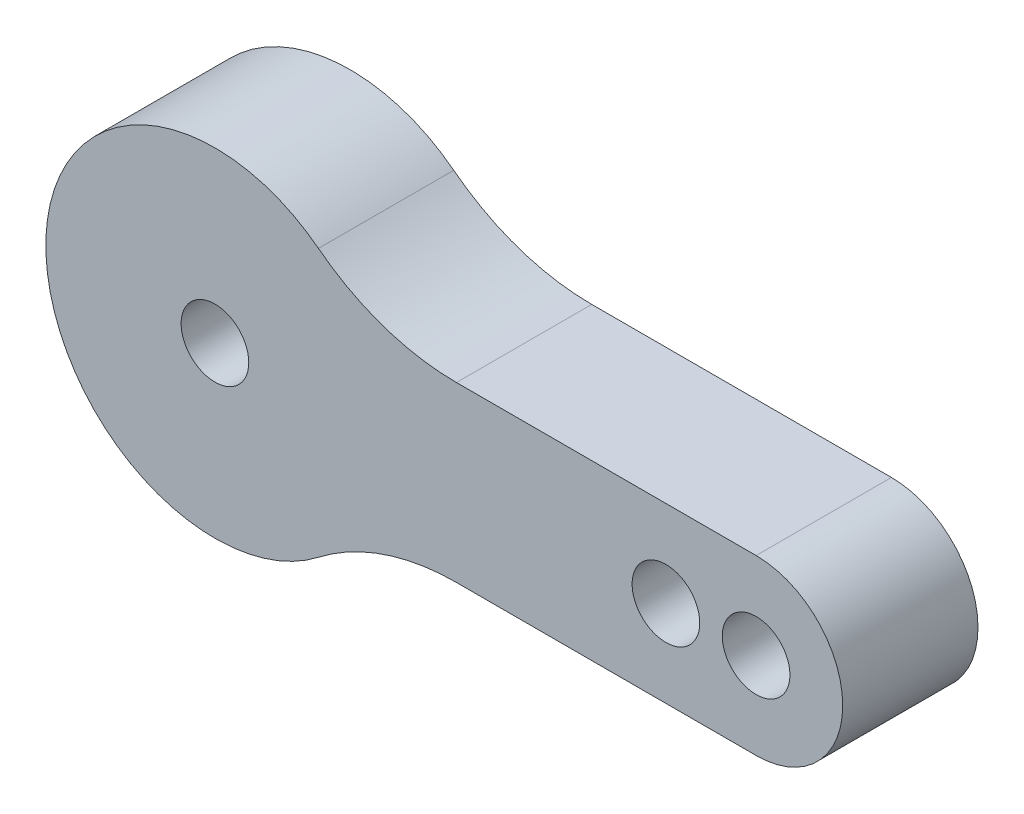
ISO-10303-21;
HEADER;
FILE_DESCRIPTION(('STEP AP214'),'2;1');
FILE_NAME('part.step','',(''),(''),'','','');
FILE_SCHEMA(('AUTOMOTIVE_DESIGN { 1 0 10303 214 1 1 1 1 }'));
ENDSEC;
DATA;
#1=APPLICATION_CONTEXT('core data for automotive mechanical design processes');
#2=APPLICATION_PROTOCOL_DEFINITION('international standard','automotive_design',2000,#1);
#3=PRODUCT_CONTEXT('',#1,'mechanical');
#4=PRODUCT('Part','Part','',(#3));
#5=PRODUCT_RELATED_PRODUCT_CATEGORY('part','',(#4));
#6=PRODUCT_DEFINITION_FORMATION('','',#4);
#7=PRODUCT_DEFINITION_CONTEXT('part definition',#1,'design');
#8=PRODUCT_DEFINITION('design','',#6,#7);
#9=PRODUCT_DEFINITION_SHAPE('','',#8);
#10=(LENGTH_UNIT() NAMED_UNIT(*) SI_UNIT(.MILLI.,.METRE.));
#11=(NAMED_UNIT(*) PLANE_ANGLE_UNIT() SI_UNIT($,.RADIAN.));
#12=(NAMED_UNIT(*) SI_UNIT($,.STERADIAN.) SOLID_ANGLE_UNIT());
#13=UNCERTAINTY_MEASURE_WITH_UNIT(LENGTH_MEASURE(1.E-05),#10,'distance_accuracy_value','');
#14=(GEOMETRIC_REPRESENTATION_CONTEXT(3) GLOBAL_UNCERTAINTY_ASSIGNED_CONTEXT((#13)) GLOBAL_UNIT_ASSIGNED_CONTEXT((#10,
#11,#12)) REPRESENTATION_CONTEXT('',''));
#15=CARTESIAN_POINT('',(0.,0.,0.));
#16=DIRECTION('',(0.,0.,1.));
#17=DIRECTION('',(1.,0.,0.));
#18=AXIS2_PLACEMENT_3D('',#15,#16,#17);
#19=CARTESIAN_POINT('',(10.7100140055931,-13.84,6.));
#20=DIRECTION('',(0.,0.,1.));
#21=DIRECTION('',(1.,0.,0.));
#22=AXIS2_PLACEMENT_3D('',#19,#20,#21);
#23=PLANE('',#22);
#24=CARTESIAN_POINT('',(20.,0.,6.));
#25=DIRECTION('',(0.,0.,1.));
#26=DIRECTION('',(1.,0.,0.));
#27=AXIS2_PLACEMENT_3D('',#24,#25,#26);
#28=CIRCLE('',#27,1.5);
#29=CARTESIAN_POINT('',(21.5,0.,6.));
#30=VERTEX_POINT('',#29);
#31=EDGE_CURVE('E185',#30,#30,#28,.T.);
#32=ORIENTED_EDGE('',*,*,#31,.F.);
#33=EDGE_LOOP('',(#32));
#34=FACE_BOUND('',#33,.T.);
#35=CARTESIAN_POINT('',(10.7100140055931,-13.84,6.));
#36=DIRECTION('',(0.,0.,-1.));
#37=DIRECTION('',(1.,0.,0.));
#38=AXIS2_PLACEMENT_3D('',#35,#36,#37);
#39=CIRCLE('',#38,10.);
#40=CARTESIAN_POINT('',(4.59000600239703,-5.93142857142857,6.));
#41=VERTEX_POINT('',#40);
#42=CARTESIAN_POINT('',(10.7100140055931,-3.84,6.));
#43=VERTEX_POINT('',#42);
#44=EDGE_CURVE('E130',#41,#43,#39,.T.);
#45=ORIENTED_EDGE('',*,*,#44,.T.);
#46=DIRECTION('',(1.,0.,0.));
#47=VECTOR('',#46,1.);
#48=CARTESIAN_POINT('',(24.,-3.84,6.));
#49=LINE('',#48,#47);
#50=CARTESIAN_POINT('',(24.,-3.84,6.));
#51=VERTEX_POINT('',#50);
#52=EDGE_CURVE('E88',#43,#51,#49,.T.);
#53=ORIENTED_EDGE('',*,*,#52,.T.);
#54=CARTESIAN_POINT('',(24.,0.,6.));
#55=DIRECTION('',(0.,0.,1.));
#56=DIRECTION('',(1.,0.,0.));
#57=AXIS2_PLACEMENT_3D('',#54,#55,#56);
#58=CIRCLE('',#57,3.84);
#59=CARTESIAN_POINT('',(24.,3.84,6.));
#60=VERTEX_POINT('',#59);
#61=EDGE_CURVE('E101',#51,#60,#58,.T.);
#62=ORIENTED_EDGE('',*,*,#61,.T.);
#63=DIRECTION('',(-1.,0.,0.));
#64=VECTOR('',#63,1.);
#65=CARTESIAN_POINT('',(24.,3.84,6.));
#66=LINE('',#65,#64);
#67=CARTESIAN_POINT('',(10.7100140055931,3.84,6.));
#68=VERTEX_POINT('',#67);
#69=EDGE_CURVE('E95',#60,#68,#66,.T.);
#70=ORIENTED_EDGE('',*,*,#69,.T.);
#71=CARTESIAN_POINT('',(10.7100140055931,13.84,6.));
#72=DIRECTION('',(0.,0.,-1.));
#73=DIRECTION('',(-1.,0.,0.));
#74=AXIS2_PLACEMENT_3D('',#71,#72,#73);
#75=CIRCLE('',#74,10.);
#76=CARTESIAN_POINT('',(4.59000600239704,5.93142857142857,6.));
#77=VERTEX_POINT('',#76);
#78=EDGE_CURVE('E99',#68,#77,#75,.T.);
#79=ORIENTED_EDGE('',*,*,#78,.T.);
#80=CARTESIAN_POINT('',(0.,0.,6.));
#81=DIRECTION('',(0.,0.,1.));
#82=DIRECTION('',(1.,0.,0.));
#83=AXIS2_PLACEMENT_3D('',#80,#81,#82);
#84=CIRCLE('',#83,7.5);
#85=EDGE_CURVE('E51',#77,#41,#84,.T.);
#86=ORIENTED_EDGE('',*,*,#85,.T.);
#87=EDGE_LOOP('',(#45,#53,#62,#70,#79,#86));
#88=FACE_BOUND('',#87,.T.);
#89=CARTESIAN_POINT('',(0.,0.,6.));
#90=DIRECTION('',(0.,0.,1.));
#91=DIRECTION('',(1.,0.,0.));
#92=AXIS2_PLACEMENT_3D('',#89,#90,#91);
#93=CIRCLE('',#92,1.5);
#94=CARTESIAN_POINT('',(1.5,0.,6.));
#95=VERTEX_POINT('',#94);
#96=EDGE_CURVE('E123',#95,#95,#93,.T.);
#97=ORIENTED_EDGE('',*,*,#96,.F.);
#98=EDGE_LOOP('',(#97));
#99=FACE_BOUND('',#98,.T.);
#100=CARTESIAN_POINT('',(24.,0.,6.));
#101=DIRECTION('',(0.,0.,1.));
#102=DIRECTION('',(1.,0.,0.));
#103=AXIS2_PLACEMENT_3D('',#100,#101,#102);
#104=CIRCLE('',#103,1.5);
#105=CARTESIAN_POINT('',(25.5,0.,6.));
#106=VERTEX_POINT('',#105);
#107=EDGE_CURVE('E176',#106,#106,#104,.T.);
#108=ORIENTED_EDGE('',*,*,#107,.F.);
#109=EDGE_LOOP('',(#108));
#110=FACE_BOUND('',#109,.T.);
#111=ADVANCED_FACE('F34',(#34,#88,#99,#110),#23,.T.);
#112=CARTESIAN_POINT('',(10.7100140055931,-13.84,0.));
#113=DIRECTION('',(0.,0.,1.));
#114=DIRECTION('',(1.,0.,0.));
#115=AXIS2_PLACEMENT_3D('',#112,#113,#114);
#116=PLANE('',#115);
#117=CARTESIAN_POINT('',(10.7100140055931,-13.84,0.));
#118=DIRECTION('',(0.,0.,-1.));
#119=DIRECTION('',(1.,0.,0.));
#120=AXIS2_PLACEMENT_3D('',#117,#118,#119);
#121=CIRCLE('',#120,10.);
#122=CARTESIAN_POINT('',(4.59000600239703,-5.93142857142857,0.));
#123=VERTEX_POINT('',#122);
#124=CARTESIAN_POINT('',(10.7100140055931,-3.84,0.));
#125=VERTEX_POINT('',#124);
#126=EDGE_CURVE('E119',#123,#125,#121,.T.);
#127=ORIENTED_EDGE('',*,*,#126,.F.);
#128=CARTESIAN_POINT('',(0.,0.,0.));
#129=DIRECTION('',(0.,0.,1.));
#130=DIRECTION('',(1.,0.,0.));
#131=AXIS2_PLACEMENT_3D('',#128,#129,#130);
#132=CIRCLE('',#131,7.5);
#133=CARTESIAN_POINT('',(4.59000600239704,5.93142857142857,0.));
#134=VERTEX_POINT('',#133);
#135=EDGE_CURVE('E80',#134,#123,#132,.T.);
#136=ORIENTED_EDGE('',*,*,#135,.F.);
#137=CARTESIAN_POINT('',(10.7100140055931,13.84,0.));
#138=DIRECTION('',(0.,0.,-1.));
#139=DIRECTION('',(-1.,0.,0.));
#140=AXIS2_PLACEMENT_3D('',#137,#138,#139);
#141=CIRCLE('',#140,10.);
#142=CARTESIAN_POINT('',(10.7100140055931,3.84,0.));
#143=VERTEX_POINT('',#142);
#144=EDGE_CURVE('E74',#143,#134,#141,.T.);
#145=ORIENTED_EDGE('',*,*,#144,.F.);
#146=DIRECTION('',(-1.,0.,0.));
#147=VECTOR('',#146,1.);
#148=CARTESIAN_POINT('',(24.,3.84,0.));
#149=LINE('',#148,#147);
#150=CARTESIAN_POINT('',(24.,3.84,0.));
#151=VERTEX_POINT('',#150);
#152=EDGE_CURVE('E109',#151,#143,#149,.T.);
#153=ORIENTED_EDGE('',*,*,#152,.F.);
#154=CARTESIAN_POINT('',(24.,0.,0.));
#155=DIRECTION('',(0.,0.,1.));
#156=DIRECTION('',(1.,0.,0.));
#157=AXIS2_PLACEMENT_3D('',#154,#155,#156);
#158=CIRCLE('',#157,3.84);
#159=CARTESIAN_POINT('',(24.,-3.84,0.));
#160=VERTEX_POINT('',#159);
#161=EDGE_CURVE('E125',#160,#151,#158,.T.);
#162=ORIENTED_EDGE('',*,*,#161,.F.);
#163=DIRECTION('',(1.,0.,0.));
#164=VECTOR('',#163,1.);
#165=CARTESIAN_POINT('',(24.,-3.84,0.));
#166=LINE('',#165,#164);
#167=EDGE_CURVE('E122',#125,#160,#166,.T.);
#168=ORIENTED_EDGE('',*,*,#167,.F.);
#169=EDGE_LOOP('',(#127,#136,#145,#153,#162,#168));
#170=FACE_BOUND('',#169,.T.);
#171=CARTESIAN_POINT('',(0.,0.,0.));
#172=DIRECTION('',(0.,0.,1.));
#173=DIRECTION('',(1.,0.,0.));
#174=AXIS2_PLACEMENT_3D('',#171,#172,#173);
#175=CIRCLE('',#174,1.5);
#176=CARTESIAN_POINT('',(1.5,0.,0.));
#177=VERTEX_POINT('',#176);
#178=EDGE_CURVE('E188',#177,#177,#175,.T.);
#179=ORIENTED_EDGE('',*,*,#178,.T.);
#180=EDGE_LOOP('',(#179));
#181=FACE_BOUND('',#180,.T.);
#182=CARTESIAN_POINT('',(20.,0.,0.));
#183=DIRECTION('',(0.,0.,1.));
#184=DIRECTION('',(1.,0.,0.));
#185=AXIS2_PLACEMENT_3D('',#182,#183,#184);
#186=CIRCLE('',#185,1.5);
#187=CARTESIAN_POINT('',(21.5,0.,0.));
#188=VERTEX_POINT('',#187);
#189=EDGE_CURVE('E182',#188,#188,#186,.T.);
#190=ORIENTED_EDGE('',*,*,#189,.T.);
#191=EDGE_LOOP('',(#190));
#192=FACE_BOUND('',#191,.T.);
#193=CARTESIAN_POINT('',(24.,0.,0.));
#194=DIRECTION('',(0.,0.,1.));
#195=DIRECTION('',(1.,0.,0.));
#196=AXIS2_PLACEMENT_3D('',#193,#194,#195);
#197=CIRCLE('',#196,1.5);
#198=CARTESIAN_POINT('',(25.5,0.,0.));
#199=VERTEX_POINT('',#198);
#200=EDGE_CURVE('E179',#199,#199,#197,.T.);
#201=ORIENTED_EDGE('',*,*,#200,.T.);
#202=EDGE_LOOP('',(#201));
#203=FACE_BOUND('',#202,.T.);
#204=ADVANCED_FACE('F139',(#170,#181,#192,#203),#116,.F.);
#205=CARTESIAN_POINT('',(10.7100140055931,-13.84,6.));
#206=DIRECTION('',(0.,0.,-1.));
#207=DIRECTION('',(-1.,0.,0.));
#208=AXIS2_PLACEMENT_3D('',#205,#206,#207);
#209=CYLINDRICAL_SURFACE('',#208,10.);
#210=ORIENTED_EDGE('',*,*,#126,.T.);
#211=DIRECTION('',(0.,0.,-1.));
#212=VECTOR('',#211,1.);
#213=CARTESIAN_POINT('',(10.7100140055931,-3.84,6.));
#214=LINE('',#213,#212);
#215=EDGE_CURVE('E11',#43,#125,#214,.T.);
#216=ORIENTED_EDGE('',*,*,#215,.F.);
#217=ORIENTED_EDGE('',*,*,#44,.F.);
#218=DIRECTION('',(0.,0.,-1.));
#219=VECTOR('',#218,1.);
#220=CARTESIAN_POINT('',(4.59000600239703,-5.93142857142857,6.));
#221=LINE('',#220,#219);
#222=EDGE_CURVE('E115',#41,#123,#221,.T.);
#223=ORIENTED_EDGE('',*,*,#222,.T.);
#224=EDGE_LOOP('',(#210,#216,#217,#223));
#225=FACE_BOUND('',#224,.T.);
#226=ADVANCED_FACE('F36',(#225),#209,.F.);
#227=CARTESIAN_POINT('',(24.,-3.84,6.));
#228=DIRECTION('',(0.,1.,0.));
#229=DIRECTION('',(0.,0.,1.));
#230=AXIS2_PLACEMENT_3D('',#227,#228,#229);
#231=PLANE('',#230);
#232=ORIENTED_EDGE('',*,*,#167,.T.);
#233=DIRECTION('',(0.,0.,-1.));
#234=VECTOR('',#233,1.);
#235=CARTESIAN_POINT('',(24.,-3.84,6.));
#236=LINE('',#235,#234);
#237=EDGE_CURVE('E43',#51,#160,#236,.T.);
#238=ORIENTED_EDGE('',*,*,#237,.F.);
#239=ORIENTED_EDGE('',*,*,#52,.F.);
#240=ORIENTED_EDGE('',*,*,#215,.T.);
#241=EDGE_LOOP('',(#232,#238,#239,#240));
#242=FACE_BOUND('',#241,.T.);
#243=ADVANCED_FACE('F238',(#242),#231,.F.);
#244=CARTESIAN_POINT('',(24.,0.,6.));
#245=DIRECTION('',(0.,0.,-1.));
#246=DIRECTION('',(-1.,0.,0.));
#247=AXIS2_PLACEMENT_3D('',#244,#245,#246);
#248=CYLINDRICAL_SURFACE('',#247,3.84);
#249=ORIENTED_EDGE('',*,*,#161,.T.);
#250=DIRECTION('',(0.,0.,-1.));
#251=VECTOR('',#250,1.);
#252=CARTESIAN_POINT('',(24.,3.84,6.));
#253=LINE('',#252,#251);
#254=EDGE_CURVE('E110',#60,#151,#253,.T.);
#255=ORIENTED_EDGE('',*,*,#254,.F.);
#256=ORIENTED_EDGE('',*,*,#61,.F.);
#257=ORIENTED_EDGE('',*,*,#237,.T.);
#258=EDGE_LOOP('',(#249,#255,#256,#257));
#259=FACE_BOUND('',#258,.T.);
#260=ADVANCED_FACE('F136',(#259),#248,.T.);
#261=CARTESIAN_POINT('',(24.,3.84,6.));
#262=DIRECTION('',(0.,-1.,0.));
#263=DIRECTION('',(0.,0.,-1.));
#264=AXIS2_PLACEMENT_3D('',#261,#262,#263);
#265=PLANE('',#264);
#266=ORIENTED_EDGE('',*,*,#152,.T.);
#267=DIRECTION('',(0.,0.,-1.));
#268=VECTOR('',#267,1.);
#269=CARTESIAN_POINT('',(10.7100140055931,3.84,6.));
#270=LINE('',#269,#268);
#271=EDGE_CURVE('E106',#68,#143,#270,.T.);
#272=ORIENTED_EDGE('',*,*,#271,.F.);
#273=ORIENTED_EDGE('',*,*,#69,.F.);
#274=ORIENTED_EDGE('',*,*,#254,.T.);
#275=EDGE_LOOP('',(#266,#272,#273,#274));
#276=FACE_BOUND('',#275,.T.);
#277=ADVANCED_FACE('F107',(#276),#265,.F.);
#278=CARTESIAN_POINT('',(10.7100140055931,13.84,6.));
#279=DIRECTION('',(0.,0.,-1.));
#280=DIRECTION('',(-1.,0.,0.));
#281=AXIS2_PLACEMENT_3D('',#278,#279,#280);
#282=CYLINDRICAL_SURFACE('',#281,10.);
#283=ORIENTED_EDGE('',*,*,#144,.T.);
#284=DIRECTION('',(0.,0.,-1.));
#285=VECTOR('',#284,1.);
#286=CARTESIAN_POINT('',(4.59000600239704,5.93142857142857,6.));
#287=LINE('',#286,#285);
#288=EDGE_CURVE('E111',#77,#134,#287,.T.);
#289=ORIENTED_EDGE('',*,*,#288,.F.);
#290=ORIENTED_EDGE('',*,*,#78,.F.);
#291=ORIENTED_EDGE('',*,*,#271,.T.);
#292=EDGE_LOOP('',(#283,#289,#290,#291));
#293=FACE_BOUND('',#292,.T.);
#294=ADVANCED_FACE('F113',(#293),#282,.F.);
#295=CARTESIAN_POINT('',(0.,0.,6.));
#296=DIRECTION('',(0.,0.,-1.));
#297=DIRECTION('',(-1.,0.,0.));
#298=AXIS2_PLACEMENT_3D('',#295,#296,#297);
#299=CYLINDRICAL_SURFACE('',#298,7.5);
#300=ORIENTED_EDGE('',*,*,#135,.T.);
#301=ORIENTED_EDGE('',*,*,#222,.F.);
#302=ORIENTED_EDGE('',*,*,#85,.F.);
#303=ORIENTED_EDGE('',*,*,#288,.T.);
#304=EDGE_LOOP('',(#300,#301,#302,#303));
#305=FACE_BOUND('',#304,.T.);
#306=ADVANCED_FACE('F144',(#305),#299,.T.);
#307=CARTESIAN_POINT('',(0.,0.,6.));
#308=DIRECTION('',(0.,0.,-1.));
#309=DIRECTION('',(-1.,0.,0.));
#310=AXIS2_PLACEMENT_3D('',#307,#308,#309);
#311=CYLINDRICAL_SURFACE('',#310,1.5);
#312=ORIENTED_EDGE('',*,*,#96,.T.);
#313=EDGE_LOOP('',(#312));
#314=FACE_BOUND('',#313,.T.);
#315=ORIENTED_EDGE('',*,*,#178,.F.);
#316=EDGE_LOOP('',(#315));
#317=FACE_BOUND('',#316,.T.);
#318=ADVANCED_FACE('F146',(#314,#317),#311,.F.);
#319=CARTESIAN_POINT('',(20.,0.,6.));
#320=DIRECTION('',(0.,0.,-1.));
#321=DIRECTION('',(-1.,0.,0.));
#322=AXIS2_PLACEMENT_3D('',#319,#320,#321);
#323=CYLINDRICAL_SURFACE('',#322,1.5);
#324=ORIENTED_EDGE('',*,*,#31,.T.);
#325=EDGE_LOOP('',(#324));
#326=FACE_BOUND('',#325,.T.);
#327=ORIENTED_EDGE('',*,*,#189,.F.);
#328=EDGE_LOOP('',(#327));
#329=FACE_BOUND('',#328,.T.);
#330=ADVANCED_FACE('F152',(#326,#329),#323,.F.);
#331=CARTESIAN_POINT('',(24.,0.,6.));
#332=DIRECTION('',(0.,0.,-1.));
#333=DIRECTION('',(-1.,0.,0.));
#334=AXIS2_PLACEMENT_3D('',#331,#332,#333);
#335=CYLINDRICAL_SURFACE('',#334,1.5);
#336=ORIENTED_EDGE('',*,*,#107,.T.);
#337=EDGE_LOOP('',(#336));
#338=FACE_BOUND('',#337,.T.);
#339=ORIENTED_EDGE('',*,*,#200,.F.);
#340=EDGE_LOOP('',(#339));
#341=FACE_BOUND('',#340,.T.);
#342=ADVANCED_FACE('F167',(#338,#341),#335,.F.);
#343=CLOSED_SHELL('',(#111,#204,#226,#243,#260,#277,#294,#306,#318,#330,#342));
#344=MANIFOLD_SOLID_BREP('B2',#343);
#345=ADVANCED_BREP_SHAPE_REPRESENTATION('',(#18,#344),#14);
#346=SHAPE_DEFINITION_REPRESENTATION(#9,#345);
ENDSEC;
END-ISO-10303-21;
